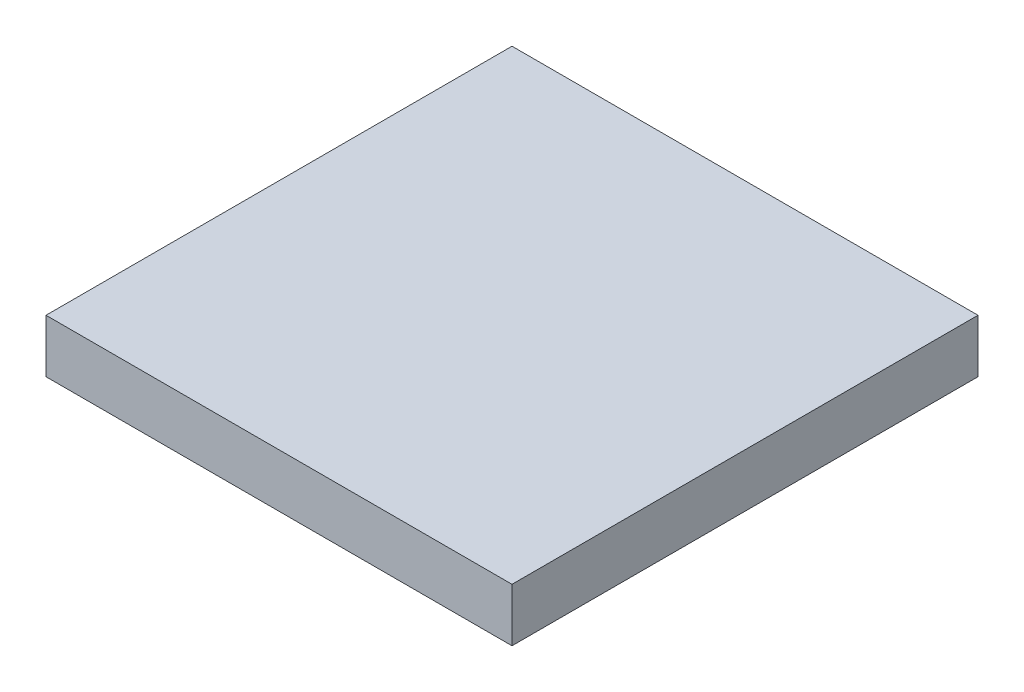
ISO-10303-21;
HEADER;
FILE_DESCRIPTION(('STEP AP214'),'2;1');
FILE_NAME('part.step','',(''),(''),'','','');
FILE_SCHEMA(('AUTOMOTIVE_DESIGN { 1 0 10303 214 1 1 1 1 }'));
ENDSEC;
DATA;
#1=APPLICATION_CONTEXT('core data for automotive mechanical design processes');
#2=APPLICATION_PROTOCOL_DEFINITION('international standard','automotive_design',2000,#1);
#3=PRODUCT_CONTEXT('',#1,'mechanical');
#4=PRODUCT('Part','Part','',(#3));
#5=PRODUCT_RELATED_PRODUCT_CATEGORY('part','',(#4));
#6=PRODUCT_DEFINITION_FORMATION('','',#4);
#7=PRODUCT_DEFINITION_CONTEXT('part definition',#1,'design');
#8=PRODUCT_DEFINITION('design','',#6,#7);
#9=PRODUCT_DEFINITION_SHAPE('','',#8);
#10=(LENGTH_UNIT() NAMED_UNIT(*) SI_UNIT(.MILLI.,.METRE.));
#11=(NAMED_UNIT(*) PLANE_ANGLE_UNIT() SI_UNIT($,.RADIAN.));
#12=(NAMED_UNIT(*) SI_UNIT($,.STERADIAN.) SOLID_ANGLE_UNIT());
#13=UNCERTAINTY_MEASURE_WITH_UNIT(LENGTH_MEASURE(1.E-05),#10,'distance_accuracy_value','');
#14=(GEOMETRIC_REPRESENTATION_CONTEXT(3) GLOBAL_UNCERTAINTY_ASSIGNED_CONTEXT((#13)) GLOBAL_UNIT_ASSIGNED_CONTEXT((#10,
#11,#12)) REPRESENTATION_CONTEXT('',''));
#15=CARTESIAN_POINT('',(0.,0.,0.));
#16=DIRECTION('',(0.,0.,1.));
#17=DIRECTION('',(1.,0.,0.));
#18=AXIS2_PLACEMENT_3D('',#15,#16,#17);
#19=CARTESIAN_POINT('',(5.675,-2.45,-36.53));
#20=DIRECTION('',(0.,-1.,0.));
#21=DIRECTION('',(1.,0.,0.));
#22=AXIS2_PLACEMENT_3D('',#19,#20,#21);
#23=PLANE('',#22);
#24=DIRECTION('',(0.,0.,-1.));
#25=VECTOR('',#24,1.);
#26=CARTESIAN_POINT('',(19.675,-2.45,-29.53));
#27=LINE('',#26,#25);
#28=CARTESIAN_POINT('',(19.675,-2.45,-22.53));
#29=VERTEX_POINT('',#28);
#30=CARTESIAN_POINT('',(19.675,-2.45,-36.53));
#31=VERTEX_POINT('',#30);
#32=EDGE_CURVE('E54',#29,#31,#27,.T.);
#33=ORIENTED_EDGE('',*,*,#32,.F.);
#34=DIRECTION('',(1.,0.,0.));
#35=VECTOR('',#34,1.);
#36=CARTESIAN_POINT('',(12.675,-2.45,-22.53));
#37=LINE('',#36,#35);
#38=CARTESIAN_POINT('',(5.675,-2.45,-22.53));
#39=VERTEX_POINT('',#38);
#40=EDGE_CURVE('E69',#39,#29,#37,.T.);
#41=ORIENTED_EDGE('',*,*,#40,.F.);
#42=DIRECTION('',(0.,0.,1.));
#43=VECTOR('',#42,1.);
#44=CARTESIAN_POINT('',(5.675,-2.45,-29.53));
#45=LINE('',#44,#43);
#46=CARTESIAN_POINT('',(5.675,-2.45,-36.53));
#47=VERTEX_POINT('',#46);
#48=EDGE_CURVE('E21',#47,#39,#45,.T.);
#49=ORIENTED_EDGE('',*,*,#48,.F.);
#50=DIRECTION('',(-1.,0.,0.));
#51=VECTOR('',#50,1.);
#52=CARTESIAN_POINT('',(12.675,-2.45,-36.53));
#53=LINE('',#52,#51);
#54=EDGE_CURVE('E59',#31,#47,#53,.T.);
#55=ORIENTED_EDGE('',*,*,#54,.F.);
#56=EDGE_LOOP('',(#33,#41,#49,#55));
#57=FACE_BOUND('',#56,.T.);
#58=ADVANCED_FACE('F17',(#57),#23,.T.);
#59=CARTESIAN_POINT('',(5.675,-0.85,-22.53));
#60=DIRECTION('',(-1.,0.,0.));
#61=DIRECTION('',(0.,0.,-1.));
#62=AXIS2_PLACEMENT_3D('',#59,#60,#61);
#63=PLANE('',#62);
#64=ORIENTED_EDGE('',*,*,#48,.T.);
#65=DIRECTION('',(0.,-1.,0.));
#66=VECTOR('',#65,1.);
#67=CARTESIAN_POINT('',(5.675,-1.65,-22.53));
#68=LINE('',#67,#66);
#69=CARTESIAN_POINT('',(5.675,-0.85,-22.53));
#70=VERTEX_POINT('',#69);
#71=EDGE_CURVE('E80',#70,#39,#68,.T.);
#72=ORIENTED_EDGE('',*,*,#71,.F.);
#73=DIRECTION('',(0.,0.,-1.));
#74=VECTOR('',#73,1.);
#75=CARTESIAN_POINT('',(5.675,-0.85,-29.53));
#76=LINE('',#75,#74);
#77=CARTESIAN_POINT('',(5.675,-0.85,-36.53));
#78=VERTEX_POINT('',#77);
#79=EDGE_CURVE('E75',#70,#78,#76,.T.);
#80=ORIENTED_EDGE('',*,*,#79,.T.);
#81=DIRECTION('',(0.,1.,0.));
#82=VECTOR('',#81,1.);
#83=CARTESIAN_POINT('',(5.675,-1.65,-36.53));
#84=LINE('',#83,#82);
#85=EDGE_CURVE('E64',#47,#78,#84,.T.);
#86=ORIENTED_EDGE('',*,*,#85,.F.);
#87=EDGE_LOOP('',(#64,#72,#80,#86));
#88=FACE_BOUND('',#87,.T.);
#89=ADVANCED_FACE('F74',(#88),#63,.T.);
#90=CARTESIAN_POINT('',(5.675,-0.85,-36.53));
#91=DIRECTION('',(0.,0.,-1.));
#92=DIRECTION('',(1.,0.,0.));
#93=AXIS2_PLACEMENT_3D('',#90,#91,#92);
#94=PLANE('',#93);
#95=ORIENTED_EDGE('',*,*,#54,.T.);
#96=ORIENTED_EDGE('',*,*,#85,.T.);
#97=DIRECTION('',(1.,0.,0.));
#98=VECTOR('',#97,1.);
#99=CARTESIAN_POINT('',(12.675,-0.85,-36.53));
#100=LINE('',#99,#98);
#101=CARTESIAN_POINT('',(19.675,-0.85,-36.53));
#102=VERTEX_POINT('',#101);
#103=EDGE_CURVE('E85',#78,#102,#100,.T.);
#104=ORIENTED_EDGE('',*,*,#103,.T.);
#105=DIRECTION('',(0.,1.,0.));
#106=VECTOR('',#105,1.);
#107=CARTESIAN_POINT('',(19.675,-1.65,-36.53));
#108=LINE('',#107,#106);
#109=EDGE_CURVE('E66',#31,#102,#108,.T.);
#110=ORIENTED_EDGE('',*,*,#109,.F.);
#111=EDGE_LOOP('',(#95,#96,#104,#110));
#112=FACE_BOUND('',#111,.T.);
#113=ADVANCED_FACE('F61',(#112),#94,.T.);
#114=CARTESIAN_POINT('',(19.675,-0.85,-36.53));
#115=DIRECTION('',(1.,0.,0.));
#116=DIRECTION('',(0.,0.,1.));
#117=AXIS2_PLACEMENT_3D('',#114,#115,#116);
#118=PLANE('',#117);
#119=ORIENTED_EDGE('',*,*,#32,.T.);
#120=ORIENTED_EDGE('',*,*,#109,.T.);
#121=DIRECTION('',(0.,0.,1.));
#122=VECTOR('',#121,1.);
#123=CARTESIAN_POINT('',(19.675,-0.85,-29.53));
#124=LINE('',#123,#122);
#125=CARTESIAN_POINT('',(19.675,-0.85,-22.53));
#126=VERTEX_POINT('',#125);
#127=EDGE_CURVE('E27',#102,#126,#124,.T.);
#128=ORIENTED_EDGE('',*,*,#127,.T.);
#129=DIRECTION('',(0.,1.,0.));
#130=VECTOR('',#129,1.);
#131=CARTESIAN_POINT('',(19.675,-1.65,-22.53));
#132=LINE('',#131,#130);
#133=EDGE_CURVE('E35',#29,#126,#132,.T.);
#134=ORIENTED_EDGE('',*,*,#133,.F.);
#135=EDGE_LOOP('',(#119,#120,#128,#134));
#136=FACE_BOUND('',#135,.T.);
#137=ADVANCED_FACE('F89',(#136),#118,.T.);
#138=CARTESIAN_POINT('',(19.675,-0.85,-22.53));
#139=DIRECTION('',(0.,0.,1.));
#140=DIRECTION('',(-1.,0.,0.));
#141=AXIS2_PLACEMENT_3D('',#138,#139,#140);
#142=PLANE('',#141);
#143=ORIENTED_EDGE('',*,*,#40,.T.);
#144=ORIENTED_EDGE('',*,*,#133,.T.);
#145=DIRECTION('',(-1.,0.,0.));
#146=VECTOR('',#145,1.);
#147=CARTESIAN_POINT('',(12.675,-0.85,-22.53));
#148=LINE('',#147,#146);
#149=EDGE_CURVE('E11',#126,#70,#148,.T.);
#150=ORIENTED_EDGE('',*,*,#149,.T.);
#151=ORIENTED_EDGE('',*,*,#71,.T.);
#152=EDGE_LOOP('',(#143,#144,#150,#151));
#153=FACE_BOUND('',#152,.T.);
#154=ADVANCED_FACE('F91',(#153),#142,.T.);
#155=CARTESIAN_POINT('',(5.675,-0.85,-36.53));
#156=DIRECTION('',(0.,-1.,0.));
#157=DIRECTION('',(1.,0.,0.));
#158=AXIS2_PLACEMENT_3D('',#155,#156,#157);
#159=PLANE('',#158);
#160=ORIENTED_EDGE('',*,*,#127,.F.);
#161=ORIENTED_EDGE('',*,*,#103,.F.);
#162=ORIENTED_EDGE('',*,*,#79,.F.);
#163=ORIENTED_EDGE('',*,*,#149,.F.);
#164=EDGE_LOOP('',(#160,#161,#162,#163));
#165=FACE_BOUND('',#164,.T.);
#166=ADVANCED_FACE('F19',(#165),#159,.F.);
#167=CLOSED_SHELL('',(#58,#89,#113,#137,#154,#166));
#168=MANIFOLD_SOLID_BREP('B1',#167);
#169=ADVANCED_BREP_SHAPE_REPRESENTATION('',(#18,#168),#14);
#170=SHAPE_DEFINITION_REPRESENTATION(#9,#169);
ENDSEC;
END-ISO-10303-21;
